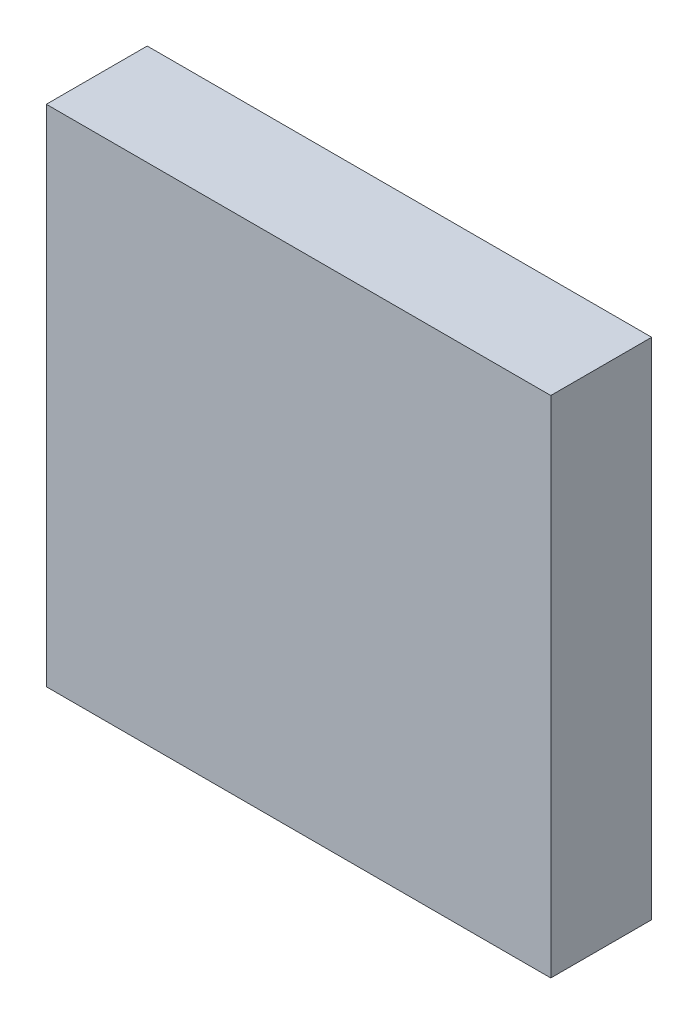
ISO-10303-21;
HEADER;
FILE_DESCRIPTION(('STEP AP214'),'2;1');
FILE_NAME('part.step','',(''),(''),'','','');
FILE_SCHEMA(('AUTOMOTIVE_DESIGN { 1 0 10303 214 1 1 1 1 }'));
ENDSEC;
DATA;
#1=APPLICATION_CONTEXT('core data for automotive mechanical design processes');
#2=APPLICATION_PROTOCOL_DEFINITION('international standard','automotive_design',2000,#1);
#3=PRODUCT_CONTEXT('',#1,'mechanical');
#4=PRODUCT('Part','Part','',(#3));
#5=PRODUCT_RELATED_PRODUCT_CATEGORY('part','',(#4));
#6=PRODUCT_DEFINITION_FORMATION('','',#4);
#7=PRODUCT_DEFINITION_CONTEXT('part definition',#1,'design');
#8=PRODUCT_DEFINITION('design','',#6,#7);
#9=PRODUCT_DEFINITION_SHAPE('','',#8);
#10=(LENGTH_UNIT() NAMED_UNIT(*) SI_UNIT(.MILLI.,.METRE.));
#11=(NAMED_UNIT(*) PLANE_ANGLE_UNIT() SI_UNIT($,.RADIAN.));
#12=(NAMED_UNIT(*) SI_UNIT($,.STERADIAN.) SOLID_ANGLE_UNIT());
#13=UNCERTAINTY_MEASURE_WITH_UNIT(LENGTH_MEASURE(1.E-05),#10,'distance_accuracy_value','');
#14=(GEOMETRIC_REPRESENTATION_CONTEXT(3) GLOBAL_UNCERTAINTY_ASSIGNED_CONTEXT((#13)) GLOBAL_UNIT_ASSIGNED_CONTEXT((#10,
#11,#12)) REPRESENTATION_CONTEXT('',''));
#15=CARTESIAN_POINT('',(0.,0.,0.));
#16=DIRECTION('',(0.,0.,1.));
#17=DIRECTION('',(1.,0.,0.));
#18=AXIS2_PLACEMENT_3D('',#15,#16,#17);
#19=CARTESIAN_POINT('',(2.00000108,2.00000108,0.80000094));
#20=DIRECTION('',(0.,0.,-1.));
#21=DIRECTION('',(-1.,0.,0.));
#22=AXIS2_PLACEMENT_3D('',#19,#20,#21);
#23=PLANE('',#22);
#24=DIRECTION('',(0.,1.,0.));
#25=VECTOR('',#24,1.);
#26=CARTESIAN_POINT('',(-2.00000108,2.00000108,0.80000094));
#27=LINE('',#26,#25);
#28=CARTESIAN_POINT('',(-2.00000108,2.00000108,0.80000094));
#29=VERTEX_POINT('',#28);
#30=CARTESIAN_POINT('',(-2.00000108,-2.00000108,0.80000094));
#31=VERTEX_POINT('',#30);
#32=EDGE_CURVE('E55',#29,#31,#27,.F.);
#33=ORIENTED_EDGE('',*,*,#32,.T.);
#34=DIRECTION('',(1.,0.,0.));
#35=VECTOR('',#34,1.);
#36=CARTESIAN_POINT('',(-2.00000108,-2.00000108,0.80000094));
#37=LINE('',#36,#35);
#38=CARTESIAN_POINT('',(2.00000108,-2.00000108,0.80000094));
#39=VERTEX_POINT('',#38);
#40=EDGE_CURVE('E57',#31,#39,#37,.T.);
#41=ORIENTED_EDGE('',*,*,#40,.T.);
#42=DIRECTION('',(0.,1.,0.));
#43=VECTOR('',#42,1.);
#44=CARTESIAN_POINT('',(2.00000108,-2.00000108,0.80000094));
#45=LINE('',#44,#43);
#46=CARTESIAN_POINT('',(2.00000108,2.00000108,0.80000094));
#47=VERTEX_POINT('',#46);
#48=EDGE_CURVE('E20',#39,#47,#45,.T.);
#49=ORIENTED_EDGE('',*,*,#48,.T.);
#50=DIRECTION('',(1.,0.,0.));
#51=VECTOR('',#50,1.);
#52=CARTESIAN_POINT('',(2.00000108,2.00000108,0.80000094));
#53=LINE('',#52,#51);
#54=EDGE_CURVE('E80',#47,#29,#53,.F.);
#55=ORIENTED_EDGE('',*,*,#54,.T.);
#56=EDGE_LOOP('',(#33,#41,#49,#55));
#57=FACE_BOUND('',#56,.T.);
#58=ADVANCED_FACE('F17',(#57),#23,.F.);
#59=CARTESIAN_POINT('',(2.00000108,-2.00000108,0.));
#60=DIRECTION('',(-1.,0.,0.));
#61=DIRECTION('',(0.,0.,1.));
#62=AXIS2_PLACEMENT_3D('',#59,#60,#61);
#63=PLANE('',#62);
#64=DIRECTION('',(0.,0.,-1.));
#65=VECTOR('',#64,1.);
#66=CARTESIAN_POINT('',(2.00000108,2.00000108,0.));
#67=LINE('',#66,#65);
#68=CARTESIAN_POINT('',(2.00000108,2.00000108,0.));
#69=VERTEX_POINT('',#68);
#70=EDGE_CURVE('E68',#69,#47,#67,.F.);
#71=ORIENTED_EDGE('',*,*,#70,.T.);
#72=ORIENTED_EDGE('',*,*,#48,.F.);
#73=DIRECTION('',(0.,0.,1.));
#74=VECTOR('',#73,1.);
#75=CARTESIAN_POINT('',(2.00000108,-2.00000108,0.));
#76=LINE('',#75,#74);
#77=CARTESIAN_POINT('',(2.00000108,-2.00000108,0.));
#78=VERTEX_POINT('',#77);
#79=EDGE_CURVE('E63',#39,#78,#76,.F.);
#80=ORIENTED_EDGE('',*,*,#79,.T.);
#81=DIRECTION('',(0.,1.,0.));
#82=VECTOR('',#81,1.);
#83=CARTESIAN_POINT('',(2.00000108,2.00000108,0.));
#84=LINE('',#83,#82);
#85=EDGE_CURVE('E83',#69,#78,#84,.F.);
#86=ORIENTED_EDGE('',*,*,#85,.F.);
#87=EDGE_LOOP('',(#71,#72,#80,#86));
#88=FACE_BOUND('',#87,.T.);
#89=ADVANCED_FACE('F65',(#88),#63,.F.);
#90=CARTESIAN_POINT('',(-2.00000108,-2.00000108,0.));
#91=DIRECTION('',(0.,1.,0.));
#92=DIRECTION('',(0.,0.,1.));
#93=AXIS2_PLACEMENT_3D('',#90,#91,#92);
#94=PLANE('',#93);
#95=ORIENTED_EDGE('',*,*,#79,.F.);
#96=ORIENTED_EDGE('',*,*,#40,.F.);
#97=DIRECTION('',(0.,0.,-1.));
#98=VECTOR('',#97,1.);
#99=CARTESIAN_POINT('',(-2.00000108,-2.00000108,0.));
#100=LINE('',#99,#98);
#101=CARTESIAN_POINT('',(-2.00000108,-2.00000108,0.));
#102=VERTEX_POINT('',#101);
#103=EDGE_CURVE('E75',#31,#102,#100,.T.);
#104=ORIENTED_EDGE('',*,*,#103,.T.);
#105=DIRECTION('',(-1.,0.,0.));
#106=VECTOR('',#105,1.);
#107=CARTESIAN_POINT('',(2.00000108,-2.00000108,0.));
#108=LINE('',#107,#106);
#109=EDGE_CURVE('E72',#78,#102,#108,.T.);
#110=ORIENTED_EDGE('',*,*,#109,.F.);
#111=EDGE_LOOP('',(#95,#96,#104,#110));
#112=FACE_BOUND('',#111,.T.);
#113=ADVANCED_FACE('F70',(#112),#94,.F.);
#114=CARTESIAN_POINT('',(-2.00000108,2.00000108,0.));
#115=DIRECTION('',(1.,0.,0.));
#116=DIRECTION('',(0.,0.,-1.));
#117=AXIS2_PLACEMENT_3D('',#114,#115,#116);
#118=PLANE('',#117);
#119=ORIENTED_EDGE('',*,*,#103,.F.);
#120=ORIENTED_EDGE('',*,*,#32,.F.);
#121=DIRECTION('',(0.,0.,-1.));
#122=VECTOR('',#121,1.);
#123=CARTESIAN_POINT('',(-2.00000108,2.00000108,0.));
#124=LINE('',#123,#122);
#125=CARTESIAN_POINT('',(-2.00000108,2.00000108,0.));
#126=VERTEX_POINT('',#125);
#127=EDGE_CURVE('E35',#29,#126,#124,.T.);
#128=ORIENTED_EDGE('',*,*,#127,.T.);
#129=DIRECTION('',(0.,1.,0.));
#130=VECTOR('',#129,1.);
#131=CARTESIAN_POINT('',(-2.00000108,2.00000108,0.));
#132=LINE('',#131,#130);
#133=EDGE_CURVE('E26',#102,#126,#132,.T.);
#134=ORIENTED_EDGE('',*,*,#133,.F.);
#135=EDGE_LOOP('',(#119,#120,#128,#134));
#136=FACE_BOUND('',#135,.T.);
#137=ADVANCED_FACE('F89',(#136),#118,.F.);
#138=CARTESIAN_POINT('',(2.00000108,2.00000108,0.));
#139=DIRECTION('',(0.,-1.,0.));
#140=DIRECTION('',(0.,0.,-1.));
#141=AXIS2_PLACEMENT_3D('',#138,#139,#140);
#142=PLANE('',#141);
#143=ORIENTED_EDGE('',*,*,#127,.F.);
#144=ORIENTED_EDGE('',*,*,#54,.F.);
#145=ORIENTED_EDGE('',*,*,#70,.F.);
#146=DIRECTION('',(-1.,0.,0.));
#147=VECTOR('',#146,1.);
#148=CARTESIAN_POINT('',(2.00000108,2.00000108,0.));
#149=LINE('',#148,#147);
#150=EDGE_CURVE('E11',#126,#69,#149,.F.);
#151=ORIENTED_EDGE('',*,*,#150,.F.);
#152=EDGE_LOOP('',(#143,#144,#145,#151));
#153=FACE_BOUND('',#152,.T.);
#154=ADVANCED_FACE('F91',(#153),#142,.F.);
#155=CARTESIAN_POINT('',(2.00000108,2.00000108,0.));
#156=DIRECTION('',(0.,0.,-1.));
#157=DIRECTION('',(-1.,0.,0.));
#158=AXIS2_PLACEMENT_3D('',#155,#156,#157);
#159=PLANE('',#158);
#160=ORIENTED_EDGE('',*,*,#133,.T.);
#161=ORIENTED_EDGE('',*,*,#150,.T.);
#162=ORIENTED_EDGE('',*,*,#85,.T.);
#163=ORIENTED_EDGE('',*,*,#109,.T.);
#164=EDGE_LOOP('',(#160,#161,#162,#163));
#165=FACE_BOUND('',#164,.T.);
#166=ADVANCED_FACE('F88',(#165),#159,.T.);
#167=CLOSED_SHELL('',(#58,#89,#113,#137,#154,#166));
#168=MANIFOLD_SOLID_BREP('B1',#167);
#169=ADVANCED_BREP_SHAPE_REPRESENTATION('',(#18,#168),#14);
#170=SHAPE_DEFINITION_REPRESENTATION(#9,#169);
ENDSEC;
END-ISO-10303-21;
